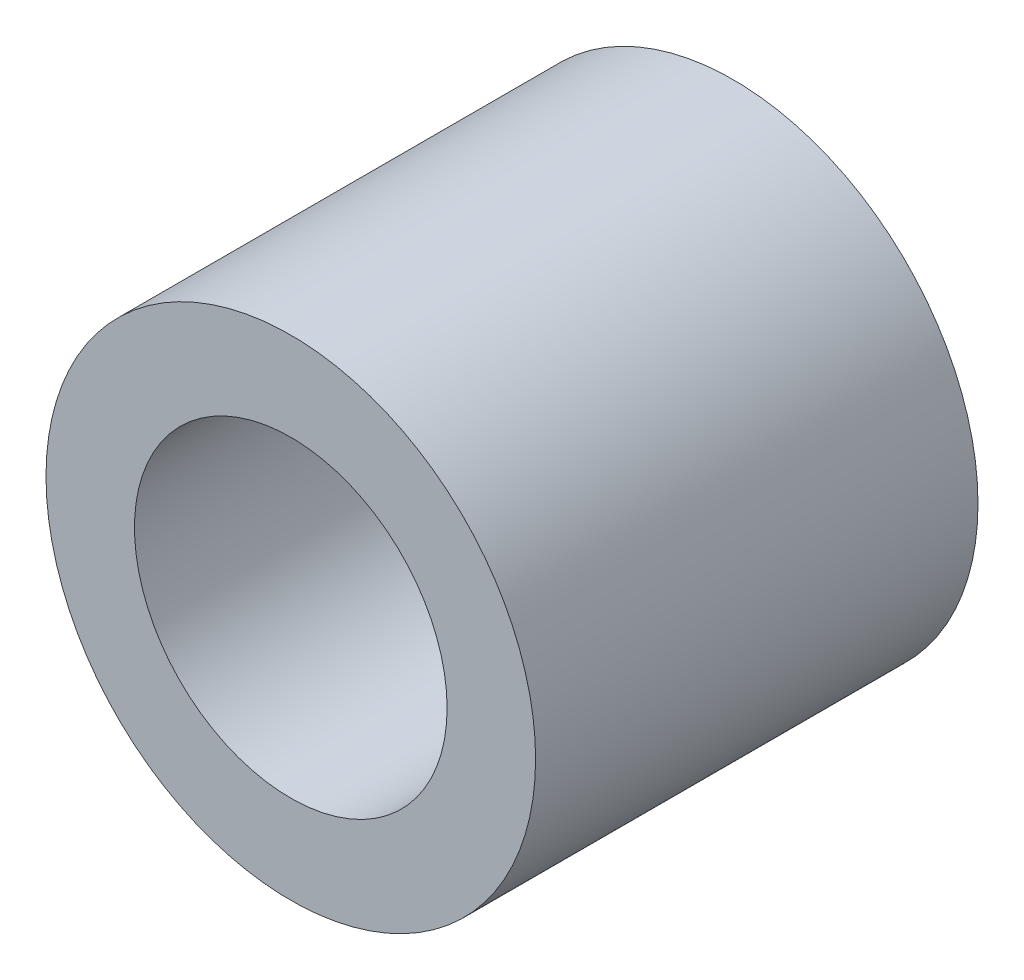
ISO-10303-21;
HEADER;
FILE_DESCRIPTION(('STEP AP214'),'2;1');
FILE_NAME('part.step','',(''),(''),'','','');
FILE_SCHEMA(('AUTOMOTIVE_DESIGN { 1 0 10303 214 1 1 1 1 }'));
ENDSEC;
DATA;
#1=APPLICATION_CONTEXT('core data for automotive mechanical design processes');
#2=APPLICATION_PROTOCOL_DEFINITION('international standard','automotive_design',2000,#1);
#3=PRODUCT_CONTEXT('',#1,'mechanical');
#4=PRODUCT('Part','Part','',(#3));
#5=PRODUCT_RELATED_PRODUCT_CATEGORY('part','',(#4));
#6=PRODUCT_DEFINITION_FORMATION('','',#4);
#7=PRODUCT_DEFINITION_CONTEXT('part definition',#1,'design');
#8=PRODUCT_DEFINITION('design','',#6,#7);
#9=PRODUCT_DEFINITION_SHAPE('','',#8);
#10=(LENGTH_UNIT() NAMED_UNIT(*) SI_UNIT(.MILLI.,.METRE.));
#11=(NAMED_UNIT(*) PLANE_ANGLE_UNIT() SI_UNIT($,.RADIAN.));
#12=(NAMED_UNIT(*) SI_UNIT($,.STERADIAN.) SOLID_ANGLE_UNIT());
#13=UNCERTAINTY_MEASURE_WITH_UNIT(LENGTH_MEASURE(1.E-05),#10,'distance_accuracy_value','');
#14=(GEOMETRIC_REPRESENTATION_CONTEXT(3) GLOBAL_UNCERTAINTY_ASSIGNED_CONTEXT((#13)) GLOBAL_UNIT_ASSIGNED_CONTEXT((#10,
#11,#12)) REPRESENTATION_CONTEXT('',''));
#15=CARTESIAN_POINT('',(0.,0.,0.));
#16=DIRECTION('',(0.,0.,1.));
#17=DIRECTION('',(1.,0.,0.));
#18=AXIS2_PLACEMENT_3D('',#15,#16,#17);
#19=CARTESIAN_POINT('',(0.,0.,7.5));
#20=DIRECTION('',(0.,0.,1.));
#21=DIRECTION('',(1.,0.,0.));
#22=AXIS2_PLACEMENT_3D('',#19,#20,#21);
#23=PLANE('',#22);
#24=CARTESIAN_POINT('',(0.,0.,7.5));
#25=DIRECTION('',(0.,0.,1.));
#26=DIRECTION('',(1.,0.,0.));
#27=AXIS2_PLACEMENT_3D('',#24,#25,#26);
#28=CIRCLE('',#27,4.15);
#29=CARTESIAN_POINT('',(4.15,0.,7.5));
#30=VERTEX_POINT('',#29);
#31=EDGE_CURVE('E10',#30,#30,#28,.T.);
#32=ORIENTED_EDGE('',*,*,#31,.T.);
#33=EDGE_LOOP('',(#32));
#34=FACE_BOUND('',#33,.T.);
#35=CARTESIAN_POINT('',(0.,0.,7.5));
#36=DIRECTION('',(0.,0.,1.));
#37=DIRECTION('',(1.,0.,0.));
#38=AXIS2_PLACEMENT_3D('',#35,#36,#37);
#39=CIRCLE('',#38,2.65);
#40=CARTESIAN_POINT('',(2.65,0.,7.5));
#41=VERTEX_POINT('',#40);
#42=EDGE_CURVE('E54',#41,#41,#39,.T.);
#43=ORIENTED_EDGE('',*,*,#42,.F.);
#44=EDGE_LOOP('',(#43));
#45=FACE_BOUND('',#44,.T.);
#46=ADVANCED_FACE('F41',(#34,#45),#23,.T.);
#47=CARTESIAN_POINT('',(0.,0.,0.));
#48=DIRECTION('',(0.,0.,1.));
#49=DIRECTION('',(1.,0.,0.));
#50=AXIS2_PLACEMENT_3D('',#47,#48,#49);
#51=PLANE('',#50);
#52=CARTESIAN_POINT('',(0.,0.,0.));
#53=DIRECTION('',(0.,0.,1.));
#54=DIRECTION('',(1.,0.,0.));
#55=AXIS2_PLACEMENT_3D('',#52,#53,#54);
#56=CIRCLE('',#55,4.15);
#57=CARTESIAN_POINT('',(4.15,0.,0.));
#58=VERTEX_POINT('',#57);
#59=EDGE_CURVE('E45',#58,#58,#56,.T.);
#60=ORIENTED_EDGE('',*,*,#59,.F.);
#61=EDGE_LOOP('',(#60));
#62=FACE_BOUND('',#61,.T.);
#63=CARTESIAN_POINT('',(0.,0.,0.));
#64=DIRECTION('',(0.,0.,1.));
#65=DIRECTION('',(1.,0.,0.));
#66=AXIS2_PLACEMENT_3D('',#63,#64,#65);
#67=CIRCLE('',#66,2.65);
#68=CARTESIAN_POINT('',(2.65,0.,0.));
#69=VERTEX_POINT('',#68);
#70=EDGE_CURVE('E56',#69,#69,#67,.T.);
#71=ORIENTED_EDGE('',*,*,#70,.T.);
#72=EDGE_LOOP('',(#71));
#73=FACE_BOUND('',#72,.T.);
#74=ADVANCED_FACE('F68',(#62,#73),#51,.F.);
#75=CARTESIAN_POINT('',(0.,0.,7.5));
#76=DIRECTION('',(0.,0.,-1.));
#77=DIRECTION('',(-1.,0.,0.));
#78=AXIS2_PLACEMENT_3D('',#75,#76,#77);
#79=CYLINDRICAL_SURFACE('',#78,4.15);
#80=ORIENTED_EDGE('',*,*,#31,.F.);
#81=EDGE_LOOP('',(#80));
#82=FACE_BOUND('',#81,.T.);
#83=ORIENTED_EDGE('',*,*,#59,.T.);
#84=EDGE_LOOP('',(#83));
#85=FACE_BOUND('',#84,.T.);
#86=ADVANCED_FACE('F43',(#82,#85),#79,.T.);
#87=CARTESIAN_POINT('',(0.,0.,7.5));
#88=DIRECTION('',(0.,0.,-1.));
#89=DIRECTION('',(-1.,0.,0.));
#90=AXIS2_PLACEMENT_3D('',#87,#88,#89);
#91=CYLINDRICAL_SURFACE('',#90,2.65);
#92=ORIENTED_EDGE('',*,*,#42,.T.);
#93=EDGE_LOOP('',(#92));
#94=FACE_BOUND('',#93,.T.);
#95=ORIENTED_EDGE('',*,*,#70,.F.);
#96=EDGE_LOOP('',(#95));
#97=FACE_BOUND('',#96,.T.);
#98=ADVANCED_FACE('F64',(#94,#97),#91,.F.);
#99=CLOSED_SHELL('',(#46,#74,#86,#98));
#100=MANIFOLD_SOLID_BREP('B2',#99);
#101=ADVANCED_BREP_SHAPE_REPRESENTATION('',(#18,#100),#14);
#102=SHAPE_DEFINITION_REPRESENTATION(#9,#101);
ENDSEC;
END-ISO-10303-21;
